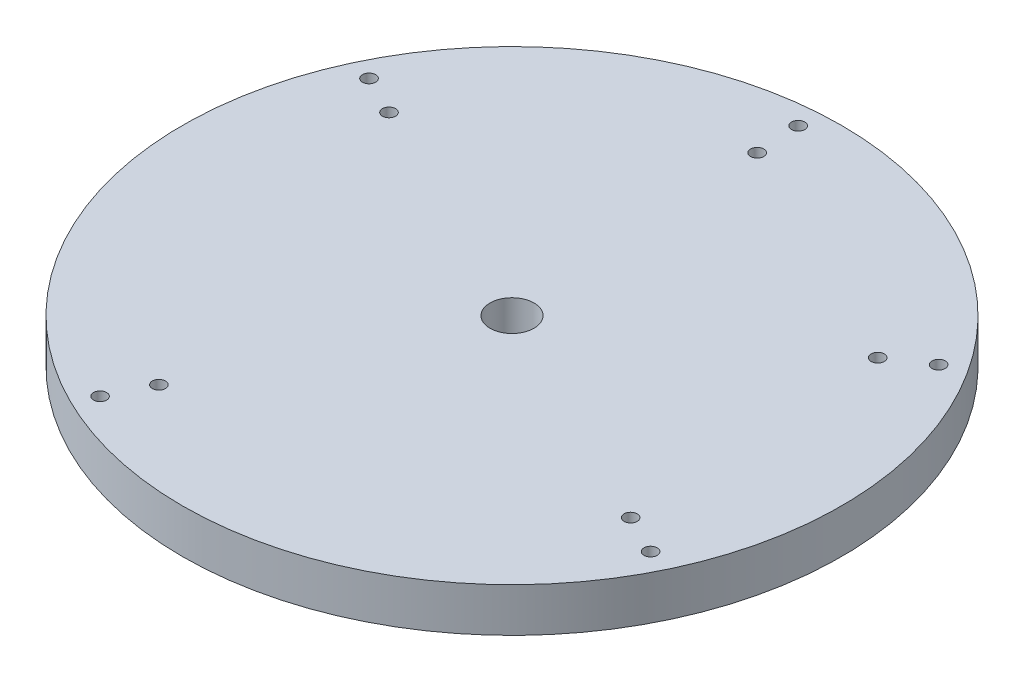
ISO-10303-21;
HEADER;
FILE_DESCRIPTION(('STEP AP214'),'2;1');
FILE_NAME('part.step','',(''),(''),'','','');
FILE_SCHEMA(('AUTOMOTIVE_DESIGN { 1 0 10303 214 1 1 1 1 }'));
ENDSEC;
DATA;
#1=APPLICATION_CONTEXT('core data for automotive mechanical design processes');
#2=APPLICATION_PROTOCOL_DEFINITION('international standard','automotive_design',2000,#1);
#3=PRODUCT_CONTEXT('',#1,'mechanical');
#4=PRODUCT('Part','Part','',(#3));
#5=PRODUCT_RELATED_PRODUCT_CATEGORY('part','',(#4));
#6=PRODUCT_DEFINITION_FORMATION('','',#4);
#7=PRODUCT_DEFINITION_CONTEXT('part definition',#1,'design');
#8=PRODUCT_DEFINITION('design','',#6,#7);
#9=PRODUCT_DEFINITION_SHAPE('','',#8);
#10=(LENGTH_UNIT() NAMED_UNIT(*) SI_UNIT(.MILLI.,.METRE.));
#11=(NAMED_UNIT(*) PLANE_ANGLE_UNIT() SI_UNIT($,.RADIAN.));
#12=(NAMED_UNIT(*) SI_UNIT($,.STERADIAN.) SOLID_ANGLE_UNIT());
#13=UNCERTAINTY_MEASURE_WITH_UNIT(LENGTH_MEASURE(1.E-05),#10,'distance_accuracy_value','');
#14=(GEOMETRIC_REPRESENTATION_CONTEXT(3) GLOBAL_UNCERTAINTY_ASSIGNED_CONTEXT((#13)) GLOBAL_UNIT_ASSIGNED_CONTEXT((#10,
#11,#12)) REPRESENTATION_CONTEXT('',''));
#15=CARTESIAN_POINT('',(0.,0.,0.));
#16=DIRECTION('',(0.,0.,1.));
#17=DIRECTION('',(1.,0.,0.));
#18=AXIS2_PLACEMENT_3D('',#15,#16,#17);
#19=CARTESIAN_POINT('',(0.,10.,0.));
#20=DIRECTION('',(0.,1.,0.));
#21=DIRECTION('',(0.,0.,1.));
#22=AXIS2_PLACEMENT_3D('',#19,#20,#21);
#23=PLANE('',#22);
#24=CARTESIAN_POINT('',(-4.85355643555324,10.,-69.9787528552354));
#25=DIRECTION('',(0.,1.,0.));
#26=DIRECTION('',(0.,0.,1.));
#27=AXIS2_PLACEMENT_3D('',#24,#25,#26);
#28=CIRCLE('',#27,1.5);
#29=CARTESIAN_POINT('',(-4.85355643555324,10.,-68.4787528552354));
#30=VERTEX_POINT('',#29);
#31=EDGE_CURVE('E55',#30,#30,#28,.T.);
#32=ORIENTED_EDGE('',*,*,#31,.F.);
#33=EDGE_LOOP('',(#32));
#34=FACE_BOUND('',#33,.T.);
#35=CARTESIAN_POINT('',(-30.9759437472511,10.,62.7733295991788));
#36=DIRECTION('',(0.,1.,0.));
#37=DIRECTION('',(0.,0.,1.));
#38=AXIS2_PLACEMENT_3D('',#35,#36,#37);
#39=CIRCLE('',#38,1.49999999999966);
#40=CARTESIAN_POINT('',(-30.9759437472511,10.,64.2733295991785));
#41=VERTEX_POINT('',#40);
#42=EDGE_CURVE('E62',#41,#41,#39,.T.);
#43=ORIENTED_EDGE('',*,*,#42,.F.);
#44=EDGE_LOOP('',(#43));
#45=FACE_BOUND('',#44,.T.);
#46=CARTESIAN_POINT('',(-54.047479175677,10.,-26.0551337504677));
#47=DIRECTION('',(0.,1.,0.));
#48=DIRECTION('',(0.,0.,1.));
#49=AXIS2_PLACEMENT_3D('',#46,#47,#48);
#50=CIRCLE('',#49,1.50000000000024);
#51=CARTESIAN_POINT('',(-54.047479175677,10.,-24.5551337504675));
#52=VERTEX_POINT('',#51);
#53=EDGE_CURVE('E66',#52,#52,#50,.T.);
#54=ORIENTED_EDGE('',*,*,#53,.F.);
#55=EDGE_LOOP('',(#54));
#56=FACE_BOUND('',#55,.T.);
#57=CARTESIAN_POINT('',(-63.0150976898452,10.,-30.480268571504));
#58=DIRECTION('',(0.,1.,0.));
#59=DIRECTION('',(0.,0.,1.));
#60=AXIS2_PLACEMENT_3D('',#57,#58,#59);
#61=CIRCLE('',#60,1.5);
#62=CARTESIAN_POINT('',(-63.0150976898452,10.,-28.980268571504));
#63=VERTEX_POINT('',#62);
#64=EDGE_CURVE('E70',#63,#63,#61,.T.);
#65=ORIENTED_EDGE('',*,*,#64,.F.);
#66=EDGE_LOOP('',(#65));
#67=FACE_BOUND('',#66,.T.);
#68=CARTESIAN_POINT('',(49.8965305636345,10.,-33.321708205197));
#69=DIRECTION('',(0.,1.,0.));
#70=DIRECTION('',(0.,0.,1.));
#71=AXIS2_PLACEMENT_3D('',#68,#69,#70);
#72=CIRCLE('',#71,1.49999999999996);
#73=CARTESIAN_POINT('',(49.8965305636345,10.,-31.821708205197));
#74=VERTEX_POINT('',#73);
#75=EDGE_CURVE('E74',#74,#74,#72,.T.);
#76=ORIENTED_EDGE('',*,*,#75,.F.);
#77=EDGE_LOOP('',(#76));
#78=FACE_BOUND('',#77,.T.);
#79=CARTESIAN_POINT('',(-4.20202634865764,10.,-60.));
#80=DIRECTION('',(0.,1.,0.));
#81=DIRECTION('',(0.,0.,1.));
#82=AXIS2_PLACEMENT_3D('',#79,#80,#81);
#83=CIRCLE('',#82,1.50000000000038);
#84=CARTESIAN_POINT('',(-4.20202634865764,10.,-58.4999999999996));
#85=VERTEX_POINT('',#84);
#86=EDGE_CURVE('E78',#85,#85,#83,.T.);
#87=ORIENTED_EDGE('',*,*,#86,.F.);
#88=EDGE_LOOP('',(#87));
#89=FACE_BOUND('',#88,.T.);
#90=CARTESIAN_POINT('',(62.2776544234311,10.,30.7341756565849));
#91=DIRECTION('',(0.,1.,0.));
#92=DIRECTION('',(0.,0.,1.));
#93=AXIS2_PLACEMENT_3D('',#90,#91,#92);
#94=CIRCLE('',#93,1.5);
#95=CARTESIAN_POINT('',(62.2776544234311,10.,32.2341756565849));
#96=VERTEX_POINT('',#95);
#97=EDGE_CURVE('E82',#96,#96,#94,.T.);
#98=ORIENTED_EDGE('',*,*,#97,.F.);
#99=EDGE_LOOP('',(#98));
#100=FACE_BOUND('',#99,.T.);
#101=CARTESIAN_POINT('',(53.3100359092629,10.,26.3090408355486));
#102=DIRECTION('',(0.,1.,0.));
#103=DIRECTION('',(0.,0.,1.));
#104=AXIS2_PLACEMENT_3D('',#101,#102,#103);
#105=CIRCLE('',#104,1.49999999999973);
#106=CARTESIAN_POINT('',(53.3100359092629,10.,27.8090408355484));
#107=VERTEX_POINT('',#106);
#108=EDGE_CURVE('E86',#107,#107,#105,.T.);
#109=ORIENTED_EDGE('',*,*,#108,.F.);
#110=EDGE_LOOP('',(#109));
#111=FACE_BOUND('',#110,.T.);
#112=CARTESIAN_POINT('',(58.2126189909069,10.,-38.8753262393965));
#113=DIRECTION('',(0.,1.,0.));
#114=DIRECTION('',(0.,0.,1.));
#115=AXIS2_PLACEMENT_3D('',#112,#113,#114);
#116=CIRCLE('',#115,1.49999999999995);
#117=CARTESIAN_POINT('',(58.2126189909069,10.,-37.3753262393965));
#118=VERTEX_POINT('',#117);
#119=EDGE_CURVE('E90',#118,#118,#116,.T.);
#120=ORIENTED_EDGE('',*,*,#119,.F.);
#121=EDGE_LOOP('',(#120));
#122=FACE_BOUND('',#121,.T.);
#123=CARTESIAN_POINT('',(-26.5508089262152,10.,53.8057110850104));
#124=DIRECTION('',(0.,1.,0.));
#125=DIRECTION('',(0.,0.,1.));
#126=AXIS2_PLACEMENT_3D('',#123,#124,#125);
#127=CIRCLE('',#126,1.49999999999971);
#128=CARTESIAN_POINT('',(-26.5508089262152,10.,55.3057110850101));
#129=VERTEX_POINT('',#128);
#130=EDGE_CURVE('E94',#129,#129,#127,.T.);
#131=ORIENTED_EDGE('',*,*,#130,.F.);
#132=EDGE_LOOP('',(#131));
#133=FACE_BOUND('',#132,.T.);
#134=CARTESIAN_POINT('',(0.,10.,0.));
#135=DIRECTION('',(0.,1.,0.));
#136=DIRECTION('',(0.,0.,1.));
#137=AXIS2_PLACEMENT_3D('',#134,#135,#136);
#138=CIRCLE('',#137,75.);
#139=CARTESIAN_POINT('',(0.,10.,75.));
#140=VERTEX_POINT('',#139);
#141=EDGE_CURVE('E10',#140,#140,#138,.T.);
#142=ORIENTED_EDGE('',*,*,#141,.T.);
#143=EDGE_LOOP('',(#142));
#144=FACE_BOUND('',#143,.T.);
#145=CARTESIAN_POINT('',(0.,10.,0.));
#146=DIRECTION('',(0.,1.,0.));
#147=DIRECTION('',(0.,0.,1.));
#148=AXIS2_PLACEMENT_3D('',#145,#146,#147);
#149=CIRCLE('',#148,5.);
#150=CARTESIAN_POINT('',(0.,10.,5.));
#151=VERTEX_POINT('',#150);
#152=EDGE_CURVE('E49',#151,#151,#149,.T.);
#153=ORIENTED_EDGE('',*,*,#152,.F.);
#154=EDGE_LOOP('',(#153));
#155=FACE_BOUND('',#154,.T.);
#156=ADVANCED_FACE('F36',(#34,#45,#56,#67,#78,#89,#100,#111,#122,#133,#144,#155),#23,.T.);
#157=CARTESIAN_POINT('',(0.,0.,0.));
#158=DIRECTION('',(0.,1.,0.));
#159=DIRECTION('',(0.,0.,1.));
#160=AXIS2_PLACEMENT_3D('',#157,#158,#159);
#161=PLANE('',#160);
#162=CARTESIAN_POINT('',(-4.85355643555324,0.,-69.9787528552354));
#163=DIRECTION('',(0.,1.,0.));
#164=DIRECTION('',(0.,0.,1.));
#165=AXIS2_PLACEMENT_3D('',#162,#163,#164);
#166=CIRCLE('',#165,1.5);
#167=CARTESIAN_POINT('',(-4.85355643555324,0.,-68.4787528552354));
#168=VERTEX_POINT('',#167);
#169=EDGE_CURVE('E103',#168,#168,#166,.T.);
#170=ORIENTED_EDGE('',*,*,#169,.T.);
#171=EDGE_LOOP('',(#170));
#172=FACE_BOUND('',#171,.T.);
#173=CARTESIAN_POINT('',(-30.9759437472511,0.,62.7733295991788));
#174=DIRECTION('',(0.,1.,0.));
#175=DIRECTION('',(0.,0.,1.));
#176=AXIS2_PLACEMENT_3D('',#173,#174,#175);
#177=CIRCLE('',#176,1.49999999999966);
#178=CARTESIAN_POINT('',(-30.9759437472511,0.,64.2733295991785));
#179=VERTEX_POINT('',#178);
#180=EDGE_CURVE('E102',#179,#179,#177,.T.);
#181=ORIENTED_EDGE('',*,*,#180,.T.);
#182=EDGE_LOOP('',(#181));
#183=FACE_BOUND('',#182,.T.);
#184=CARTESIAN_POINT('',(-54.047479175677,0.,-26.0551337504677));
#185=DIRECTION('',(0.,1.,0.));
#186=DIRECTION('',(0.,0.,1.));
#187=AXIS2_PLACEMENT_3D('',#184,#185,#186);
#188=CIRCLE('',#187,1.50000000000024);
#189=CARTESIAN_POINT('',(-54.047479175677,0.,-24.5551337504675));
#190=VERTEX_POINT('',#189);
#191=EDGE_CURVE('E117',#190,#190,#188,.T.);
#192=ORIENTED_EDGE('',*,*,#191,.T.);
#193=EDGE_LOOP('',(#192));
#194=FACE_BOUND('',#193,.T.);
#195=CARTESIAN_POINT('',(-63.0150976898452,0.,-30.480268571504));
#196=DIRECTION('',(0.,1.,0.));
#197=DIRECTION('',(0.,0.,1.));
#198=AXIS2_PLACEMENT_3D('',#195,#196,#197);
#199=CIRCLE('',#198,1.5);
#200=CARTESIAN_POINT('',(-63.0150976898452,0.,-28.980268571504));
#201=VERTEX_POINT('',#200);
#202=EDGE_CURVE('E112',#201,#201,#199,.T.);
#203=ORIENTED_EDGE('',*,*,#202,.T.);
#204=EDGE_LOOP('',(#203));
#205=FACE_BOUND('',#204,.T.);
#206=CARTESIAN_POINT('',(49.8965305636345,0.,-33.321708205197));
#207=DIRECTION('',(0.,1.,0.));
#208=DIRECTION('',(0.,0.,1.));
#209=AXIS2_PLACEMENT_3D('',#206,#207,#208);
#210=CIRCLE('',#209,1.49999999999996);
#211=CARTESIAN_POINT('',(49.8965305636345,0.,-31.821708205197));
#212=VERTEX_POINT('',#211);
#213=EDGE_CURVE('E108',#212,#212,#210,.T.);
#214=ORIENTED_EDGE('',*,*,#213,.T.);
#215=EDGE_LOOP('',(#214));
#216=FACE_BOUND('',#215,.T.);
#217=CARTESIAN_POINT('',(-4.20202634865764,0.,-60.));
#218=DIRECTION('',(0.,1.,0.));
#219=DIRECTION('',(0.,0.,1.));
#220=AXIS2_PLACEMENT_3D('',#217,#218,#219);
#221=CIRCLE('',#220,1.50000000000038);
#222=CARTESIAN_POINT('',(-4.20202634865764,0.,-58.4999999999996));
#223=VERTEX_POINT('',#222);
#224=EDGE_CURVE('E107',#223,#223,#221,.T.);
#225=ORIENTED_EDGE('',*,*,#224,.T.);
#226=EDGE_LOOP('',(#225));
#227=FACE_BOUND('',#226,.T.);
#228=CARTESIAN_POINT('',(62.2776544234311,0.,30.7341756565849));
#229=DIRECTION('',(0.,1.,0.));
#230=DIRECTION('',(0.,0.,1.));
#231=AXIS2_PLACEMENT_3D('',#228,#229,#230);
#232=CIRCLE('',#231,1.5);
#233=CARTESIAN_POINT('',(62.2776544234311,0.,32.2341756565849));
#234=VERTEX_POINT('',#233);
#235=EDGE_CURVE('E128',#234,#234,#232,.T.);
#236=ORIENTED_EDGE('',*,*,#235,.T.);
#237=EDGE_LOOP('',(#236));
#238=FACE_BOUND('',#237,.T.);
#239=CARTESIAN_POINT('',(53.3100359092629,0.,26.3090408355486));
#240=DIRECTION('',(0.,1.,0.));
#241=DIRECTION('',(0.,0.,1.));
#242=AXIS2_PLACEMENT_3D('',#239,#240,#241);
#243=CIRCLE('',#242,1.49999999999973);
#244=CARTESIAN_POINT('',(53.3100359092629,0.,27.8090408355484));
#245=VERTEX_POINT('',#244);
#246=EDGE_CURVE('E124',#245,#245,#243,.T.);
#247=ORIENTED_EDGE('',*,*,#246,.T.);
#248=EDGE_LOOP('',(#247));
#249=FACE_BOUND('',#248,.T.);
#250=CARTESIAN_POINT('',(58.2126189909069,0.,-38.8753262393965));
#251=DIRECTION('',(0.,1.,0.));
#252=DIRECTION('',(0.,0.,1.));
#253=AXIS2_PLACEMENT_3D('',#250,#251,#252);
#254=CIRCLE('',#253,1.49999999999995);
#255=CARTESIAN_POINT('',(58.2126189909069,0.,-37.3753262393965));
#256=VERTEX_POINT('',#255);
#257=EDGE_CURVE('E113',#256,#256,#254,.T.);
#258=ORIENTED_EDGE('',*,*,#257,.T.);
#259=EDGE_LOOP('',(#258));
#260=FACE_BOUND('',#259,.T.);
#261=CARTESIAN_POINT('',(-26.5508089262152,0.,53.8057110850104));
#262=DIRECTION('',(0.,1.,0.));
#263=DIRECTION('',(0.,0.,1.));
#264=AXIS2_PLACEMENT_3D('',#261,#262,#263);
#265=CIRCLE('',#264,1.49999999999971);
#266=CARTESIAN_POINT('',(-26.5508089262152,0.,55.3057110850101));
#267=VERTEX_POINT('',#266);
#268=EDGE_CURVE('E98',#267,#267,#265,.T.);
#269=ORIENTED_EDGE('',*,*,#268,.T.);
#270=EDGE_LOOP('',(#269));
#271=FACE_BOUND('',#270,.T.);
#272=CARTESIAN_POINT('',(0.,0.,0.));
#273=DIRECTION('',(0.,1.,0.));
#274=DIRECTION('',(0.,0.,1.));
#275=AXIS2_PLACEMENT_3D('',#272,#273,#274);
#276=CIRCLE('',#275,75.);
#277=CARTESIAN_POINT('',(0.,0.,75.));
#278=VERTEX_POINT('',#277);
#279=EDGE_CURVE('E40',#278,#278,#276,.T.);
#280=ORIENTED_EDGE('',*,*,#279,.F.);
#281=EDGE_LOOP('',(#280));
#282=FACE_BOUND('',#281,.T.);
#283=CARTESIAN_POINT('',(0.,0.,0.));
#284=DIRECTION('',(0.,1.,0.));
#285=DIRECTION('',(0.,0.,1.));
#286=AXIS2_PLACEMENT_3D('',#283,#284,#285);
#287=CIRCLE('',#286,5.);
#288=CARTESIAN_POINT('',(0.,0.,5.));
#289=VERTEX_POINT('',#288);
#290=EDGE_CURVE('E51',#289,#289,#287,.T.);
#291=ORIENTED_EDGE('',*,*,#290,.T.);
#292=EDGE_LOOP('',(#291));
#293=FACE_BOUND('',#292,.T.);
#294=ADVANCED_FACE('F139',(#172,#183,#194,#205,#216,#227,#238,#249,#260,#271,#282,#293),#161,.F.);
#295=CARTESIAN_POINT('',(0.,10.,0.));
#296=DIRECTION('',(0.,-1.,0.));
#297=DIRECTION('',(0.,0.,-1.));
#298=AXIS2_PLACEMENT_3D('',#295,#296,#297);
#299=CYLINDRICAL_SURFACE('',#298,75.);
#300=ORIENTED_EDGE('',*,*,#141,.F.);
#301=EDGE_LOOP('',(#300));
#302=FACE_BOUND('',#301,.T.);
#303=ORIENTED_EDGE('',*,*,#279,.T.);
#304=EDGE_LOOP('',(#303));
#305=FACE_BOUND('',#304,.T.);
#306=ADVANCED_FACE('F38',(#302,#305),#299,.T.);
#307=CARTESIAN_POINT('',(0.,10.,0.));
#308=DIRECTION('',(0.,-1.,0.));
#309=DIRECTION('',(0.,0.,-1.));
#310=AXIS2_PLACEMENT_3D('',#307,#308,#309);
#311=CYLINDRICAL_SURFACE('',#310,5.);
#312=ORIENTED_EDGE('',*,*,#152,.T.);
#313=EDGE_LOOP('',(#312));
#314=FACE_BOUND('',#313,.T.);
#315=ORIENTED_EDGE('',*,*,#290,.F.);
#316=EDGE_LOOP('',(#315));
#317=FACE_BOUND('',#316,.T.);
#318=ADVANCED_FACE('F169',(#314,#317),#311,.F.);
#319=CARTESIAN_POINT('',(-26.5508089262152,0.,53.8057110850104));
#320=DIRECTION('',(0.,1.,0.));
#321=DIRECTION('',(0.,0.,1.));
#322=AXIS2_PLACEMENT_3D('',#319,#320,#321);
#323=CYLINDRICAL_SURFACE('',#322,1.49999999999971);
#324=ORIENTED_EDGE('',*,*,#130,.T.);
#325=EDGE_LOOP('',(#324));
#326=FACE_BOUND('',#325,.T.);
#327=ORIENTED_EDGE('',*,*,#268,.F.);
#328=EDGE_LOOP('',(#327));
#329=FACE_BOUND('',#328,.T.);
#330=ADVANCED_FACE('F172',(#326,#329),#323,.F.);
#331=CARTESIAN_POINT('',(58.2126189909069,0.,-38.8753262393965));
#332=DIRECTION('',(0.,1.,0.));
#333=DIRECTION('',(0.,0.,1.));
#334=AXIS2_PLACEMENT_3D('',#331,#332,#333);
#335=CYLINDRICAL_SURFACE('',#334,1.49999999999995);
#336=ORIENTED_EDGE('',*,*,#119,.T.);
#337=EDGE_LOOP('',(#336));
#338=FACE_BOUND('',#337,.T.);
#339=ORIENTED_EDGE('',*,*,#257,.F.);
#340=EDGE_LOOP('',(#339));
#341=FACE_BOUND('',#340,.T.);
#342=ADVANCED_FACE('F155',(#338,#341),#335,.F.);
#343=CARTESIAN_POINT('',(53.3100359092629,0.,26.3090408355486));
#344=DIRECTION('',(0.,1.,0.));
#345=DIRECTION('',(0.,0.,1.));
#346=AXIS2_PLACEMENT_3D('',#343,#344,#345);
#347=CYLINDRICAL_SURFACE('',#346,1.49999999999973);
#348=ORIENTED_EDGE('',*,*,#108,.T.);
#349=EDGE_LOOP('',(#348));
#350=FACE_BOUND('',#349,.T.);
#351=ORIENTED_EDGE('',*,*,#246,.F.);
#352=EDGE_LOOP('',(#351));
#353=FACE_BOUND('',#352,.T.);
#354=ADVANCED_FACE('F145',(#350,#353),#347,.F.);
#355=CARTESIAN_POINT('',(62.2776544234311,0.,30.7341756565849));
#356=DIRECTION('',(0.,1.,0.));
#357=DIRECTION('',(0.,0.,1.));
#358=AXIS2_PLACEMENT_3D('',#355,#356,#357);
#359=CYLINDRICAL_SURFACE('',#358,1.5);
#360=ORIENTED_EDGE('',*,*,#97,.T.);
#361=EDGE_LOOP('',(#360));
#362=FACE_BOUND('',#361,.T.);
#363=ORIENTED_EDGE('',*,*,#235,.F.);
#364=EDGE_LOOP('',(#363));
#365=FACE_BOUND('',#364,.T.);
#366=ADVANCED_FACE('F142',(#362,#365),#359,.F.);
#367=CARTESIAN_POINT('',(-4.20202634865764,0.,-60.));
#368=DIRECTION('',(0.,1.,0.));
#369=DIRECTION('',(0.,0.,1.));
#370=AXIS2_PLACEMENT_3D('',#367,#368,#369);
#371=CYLINDRICAL_SURFACE('',#370,1.50000000000038);
#372=ORIENTED_EDGE('',*,*,#86,.T.);
#373=EDGE_LOOP('',(#372));
#374=FACE_BOUND('',#373,.T.);
#375=ORIENTED_EDGE('',*,*,#224,.F.);
#376=EDGE_LOOP('',(#375));
#377=FACE_BOUND('',#376,.T.);
#378=ADVANCED_FACE('F144',(#374,#377),#371,.F.);
#379=CARTESIAN_POINT('',(49.8965305636345,0.,-33.321708205197));
#380=DIRECTION('',(0.,1.,0.));
#381=DIRECTION('',(0.,0.,1.));
#382=AXIS2_PLACEMENT_3D('',#379,#380,#381);
#383=CYLINDRICAL_SURFACE('',#382,1.49999999999996);
#384=ORIENTED_EDGE('',*,*,#75,.T.);
#385=EDGE_LOOP('',(#384));
#386=FACE_BOUND('',#385,.T.);
#387=ORIENTED_EDGE('',*,*,#213,.F.);
#388=EDGE_LOOP('',(#387));
#389=FACE_BOUND('',#388,.T.);
#390=ADVANCED_FACE('F152',(#386,#389),#383,.F.);
#391=CARTESIAN_POINT('',(-63.0150976898452,0.,-30.480268571504));
#392=DIRECTION('',(0.,1.,0.));
#393=DIRECTION('',(0.,0.,1.));
#394=AXIS2_PLACEMENT_3D('',#391,#392,#393);
#395=CYLINDRICAL_SURFACE('',#394,1.5);
#396=ORIENTED_EDGE('',*,*,#64,.T.);
#397=EDGE_LOOP('',(#396));
#398=FACE_BOUND('',#397,.T.);
#399=ORIENTED_EDGE('',*,*,#202,.F.);
#400=EDGE_LOOP('',(#399));
#401=FACE_BOUND('',#400,.T.);
#402=ADVANCED_FACE('F184',(#398,#401),#395,.F.);
#403=CARTESIAN_POINT('',(-54.047479175677,0.,-26.0551337504677));
#404=DIRECTION('',(0.,1.,0.));
#405=DIRECTION('',(0.,0.,1.));
#406=AXIS2_PLACEMENT_3D('',#403,#404,#405);
#407=CYLINDRICAL_SURFACE('',#406,1.50000000000024);
#408=ORIENTED_EDGE('',*,*,#53,.T.);
#409=EDGE_LOOP('',(#408));
#410=FACE_BOUND('',#409,.T.);
#411=ORIENTED_EDGE('',*,*,#191,.F.);
#412=EDGE_LOOP('',(#411));
#413=FACE_BOUND('',#412,.T.);
#414=ADVANCED_FACE('F188',(#410,#413),#407,.F.);
#415=CARTESIAN_POINT('',(-30.9759437472511,0.,62.7733295991788));
#416=DIRECTION('',(0.,1.,0.));
#417=DIRECTION('',(0.,0.,1.));
#418=AXIS2_PLACEMENT_3D('',#415,#416,#417);
#419=CYLINDRICAL_SURFACE('',#418,1.49999999999966);
#420=ORIENTED_EDGE('',*,*,#42,.T.);
#421=EDGE_LOOP('',(#420));
#422=FACE_BOUND('',#421,.T.);
#423=ORIENTED_EDGE('',*,*,#180,.F.);
#424=EDGE_LOOP('',(#423));
#425=FACE_BOUND('',#424,.T.);
#426=ADVANCED_FACE('F180',(#422,#425),#419,.F.);
#427=CARTESIAN_POINT('',(-4.85355643555324,0.,-69.9787528552354));
#428=DIRECTION('',(0.,1.,0.));
#429=DIRECTION('',(0.,0.,1.));
#430=AXIS2_PLACEMENT_3D('',#427,#428,#429);
#431=CYLINDRICAL_SURFACE('',#430,1.5);
#432=ORIENTED_EDGE('',*,*,#31,.T.);
#433=EDGE_LOOP('',(#432));
#434=FACE_BOUND('',#433,.T.);
#435=ORIENTED_EDGE('',*,*,#169,.F.);
#436=EDGE_LOOP('',(#435));
#437=FACE_BOUND('',#436,.T.);
#438=ADVANCED_FACE('F177',(#434,#437),#431,.F.);
#439=CLOSED_SHELL('',(#156,#294,#306,#318,#330,#342,#354,#366,#378,#390,#402,#414,#426,#438));
#440=MANIFOLD_SOLID_BREP('B2',#439);
#441=ADVANCED_BREP_SHAPE_REPRESENTATION('',(#18,#440),#14);
#442=SHAPE_DEFINITION_REPRESENTATION(#9,#441);
ENDSEC;
END-ISO-10303-21;
